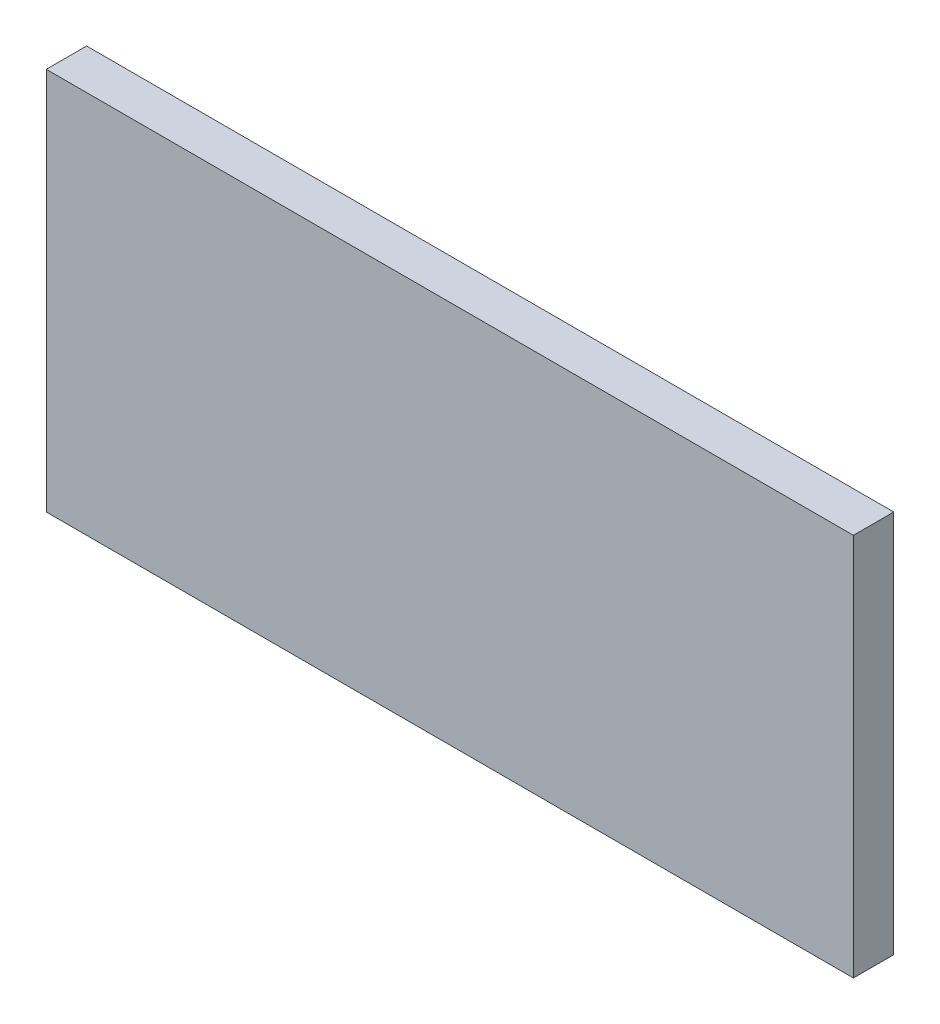
ISO-10303-21;
HEADER;
FILE_DESCRIPTION(('STEP AP214'),'2;1');
FILE_NAME('part.step','',(''),(''),'','','');
FILE_SCHEMA(('AUTOMOTIVE_DESIGN { 1 0 10303 214 1 1 1 1 }'));
ENDSEC;
DATA;
#1=APPLICATION_CONTEXT('core data for automotive mechanical design processes');
#2=APPLICATION_PROTOCOL_DEFINITION('international standard','automotive_design',2000,#1);
#3=PRODUCT_CONTEXT('',#1,'mechanical');
#4=PRODUCT('Part','Part','',(#3));
#5=PRODUCT_RELATED_PRODUCT_CATEGORY('part','',(#4));
#6=PRODUCT_DEFINITION_FORMATION('','',#4);
#7=PRODUCT_DEFINITION_CONTEXT('part definition',#1,'design');
#8=PRODUCT_DEFINITION('design','',#6,#7);
#9=PRODUCT_DEFINITION_SHAPE('','',#8);
#10=(LENGTH_UNIT() NAMED_UNIT(*) SI_UNIT(.MILLI.,.METRE.));
#11=(NAMED_UNIT(*) PLANE_ANGLE_UNIT() SI_UNIT($,.RADIAN.));
#12=(NAMED_UNIT(*) SI_UNIT($,.STERADIAN.) SOLID_ANGLE_UNIT());
#13=UNCERTAINTY_MEASURE_WITH_UNIT(LENGTH_MEASURE(1.E-05),#10,'distance_accuracy_value','');
#14=(GEOMETRIC_REPRESENTATION_CONTEXT(3) GLOBAL_UNCERTAINTY_ASSIGNED_CONTEXT((#13)) GLOBAL_UNIT_ASSIGNED_CONTEXT((#10,
#11,#12)) REPRESENTATION_CONTEXT('',''));
#15=CARTESIAN_POINT('',(0.,0.,0.));
#16=DIRECTION('',(0.,0.,1.));
#17=DIRECTION('',(1.,0.,0.));
#18=AXIS2_PLACEMENT_3D('',#15,#16,#17);
#19=CARTESIAN_POINT('',(0.,0.,2.));
#20=DIRECTION('',(1.,0.,0.));
#21=DIRECTION('',(0.,0.,-1.));
#22=AXIS2_PLACEMENT_3D('',#19,#20,#21);
#23=PLANE('',#22);
#24=DIRECTION('',(0.,-1.,0.));
#25=VECTOR('',#24,1.);
#26=CARTESIAN_POINT('',(0.,0.,0.));
#27=LINE('',#26,#25);
#28=CARTESIAN_POINT('',(0.,19.,0.));
#29=VERTEX_POINT('',#28);
#30=CARTESIAN_POINT('',(0.,0.,0.));
#31=VERTEX_POINT('',#30);
#32=EDGE_CURVE('E107',#29,#31,#27,.T.);
#33=ORIENTED_EDGE('',*,*,#32,.T.);
#34=DIRECTION('',(0.,0.,-1.));
#35=VECTOR('',#34,1.);
#36=CARTESIAN_POINT('',(0.,0.,2.));
#37=LINE('',#36,#35);
#38=CARTESIAN_POINT('',(0.,0.,2.));
#39=VERTEX_POINT('',#38);
#40=EDGE_CURVE('E11',#39,#31,#37,.T.);
#41=ORIENTED_EDGE('',*,*,#40,.F.);
#42=DIRECTION('',(0.,-1.,0.));
#43=VECTOR('',#42,1.);
#44=CARTESIAN_POINT('',(0.,0.,2.));
#45=LINE('',#44,#43);
#46=CARTESIAN_POINT('',(0.,19.,2.));
#47=VERTEX_POINT('',#46);
#48=EDGE_CURVE('E91',#47,#39,#45,.T.);
#49=ORIENTED_EDGE('',*,*,#48,.F.);
#50=DIRECTION('',(0.,0.,-1.));
#51=VECTOR('',#50,1.);
#52=CARTESIAN_POINT('',(0.,19.,2.));
#53=LINE('',#52,#51);
#54=EDGE_CURVE('E103',#47,#29,#53,.T.);
#55=ORIENTED_EDGE('',*,*,#54,.T.);
#56=EDGE_LOOP('',(#33,#41,#49,#55));
#57=FACE_BOUND('',#56,.T.);
#58=ADVANCED_FACE('F39',(#57),#23,.F.);
#59=CARTESIAN_POINT('',(0.,0.,2.));
#60=DIRECTION('',(0.,1.,0.));
#61=DIRECTION('',(0.,0.,1.));
#62=AXIS2_PLACEMENT_3D('',#59,#60,#61);
#63=PLANE('',#62);
#64=DIRECTION('',(1.,0.,0.));
#65=VECTOR('',#64,1.);
#66=CARTESIAN_POINT('',(0.,0.,0.));
#67=LINE('',#66,#65);
#68=CARTESIAN_POINT('',(40.,0.,0.));
#69=VERTEX_POINT('',#68);
#70=EDGE_CURVE('E96',#31,#69,#67,.T.);
#71=ORIENTED_EDGE('',*,*,#70,.T.);
#72=DIRECTION('',(0.,0.,-1.));
#73=VECTOR('',#72,1.);
#74=CARTESIAN_POINT('',(40.,0.,2.));
#75=LINE('',#74,#73);
#76=CARTESIAN_POINT('',(40.,0.,2.));
#77=VERTEX_POINT('',#76);
#78=EDGE_CURVE('E48',#77,#69,#75,.T.);
#79=ORIENTED_EDGE('',*,*,#78,.F.);
#80=DIRECTION('',(1.,0.,0.));
#81=VECTOR('',#80,1.);
#82=CARTESIAN_POINT('',(0.,0.,2.));
#83=LINE('',#82,#81);
#84=EDGE_CURVE('E86',#39,#77,#83,.T.);
#85=ORIENTED_EDGE('',*,*,#84,.F.);
#86=ORIENTED_EDGE('',*,*,#40,.T.);
#87=EDGE_LOOP('',(#71,#79,#85,#86));
#88=FACE_BOUND('',#87,.T.);
#89=ADVANCED_FACE('F95',(#88),#63,.F.);
#90=CARTESIAN_POINT('',(40.,0.,2.));
#91=DIRECTION('',(-1.,0.,0.));
#92=DIRECTION('',(0.,0.,1.));
#93=AXIS2_PLACEMENT_3D('',#90,#91,#92);
#94=PLANE('',#93);
#95=DIRECTION('',(0.,1.,0.));
#96=VECTOR('',#95,1.);
#97=CARTESIAN_POINT('',(40.,0.,0.));
#98=LINE('',#97,#96);
#99=CARTESIAN_POINT('',(40.,19.,0.));
#100=VERTEX_POINT('',#99);
#101=EDGE_CURVE('E73',#69,#100,#98,.T.);
#102=ORIENTED_EDGE('',*,*,#101,.T.);
#103=DIRECTION('',(0.,0.,-1.));
#104=VECTOR('',#103,1.);
#105=CARTESIAN_POINT('',(40.,19.,2.));
#106=LINE('',#105,#104);
#107=CARTESIAN_POINT('',(40.,19.,2.));
#108=VERTEX_POINT('',#107);
#109=EDGE_CURVE('E98',#108,#100,#106,.T.);
#110=ORIENTED_EDGE('',*,*,#109,.F.);
#111=DIRECTION('',(0.,1.,0.));
#112=VECTOR('',#111,1.);
#113=CARTESIAN_POINT('',(40.,0.,2.));
#114=LINE('',#113,#112);
#115=EDGE_CURVE('E89',#77,#108,#114,.T.);
#116=ORIENTED_EDGE('',*,*,#115,.F.);
#117=ORIENTED_EDGE('',*,*,#78,.T.);
#118=EDGE_LOOP('',(#102,#110,#116,#117));
#119=FACE_BOUND('',#118,.T.);
#120=ADVANCED_FACE('F99',(#119),#94,.F.);
#121=CARTESIAN_POINT('',(0.,19.,2.));
#122=DIRECTION('',(0.,-1.,0.));
#123=DIRECTION('',(0.,0.,-1.));
#124=AXIS2_PLACEMENT_3D('',#121,#122,#123);
#125=PLANE('',#124);
#126=DIRECTION('',(-1.,0.,0.));
#127=VECTOR('',#126,1.);
#128=CARTESIAN_POINT('',(0.,19.,0.));
#129=LINE('',#128,#127);
#130=EDGE_CURVE('E79',#100,#29,#129,.T.);
#131=ORIENTED_EDGE('',*,*,#130,.T.);
#132=ORIENTED_EDGE('',*,*,#54,.F.);
#133=DIRECTION('',(-1.,0.,0.));
#134=VECTOR('',#133,1.);
#135=CARTESIAN_POINT('',(0.,19.,2.));
#136=LINE('',#135,#134);
#137=EDGE_CURVE('E56',#108,#47,#136,.T.);
#138=ORIENTED_EDGE('',*,*,#137,.F.);
#139=ORIENTED_EDGE('',*,*,#109,.T.);
#140=EDGE_LOOP('',(#131,#132,#138,#139));
#141=FACE_BOUND('',#140,.T.);
#142=ADVANCED_FACE('F120',(#141),#125,.F.);
#143=CARTESIAN_POINT('',(0.,0.,2.));
#144=DIRECTION('',(0.,0.,-1.));
#145=DIRECTION('',(-1.,0.,0.));
#146=AXIS2_PLACEMENT_3D('',#143,#144,#145);
#147=PLANE('',#146);
#148=ORIENTED_EDGE('',*,*,#48,.T.);
#149=ORIENTED_EDGE('',*,*,#84,.T.);
#150=ORIENTED_EDGE('',*,*,#115,.T.);
#151=ORIENTED_EDGE('',*,*,#137,.T.);
#152=EDGE_LOOP('',(#148,#149,#150,#151));
#153=FACE_BOUND('',#152,.T.);
#154=ADVANCED_FACE('F87',(#153),#147,.F.);
#155=CARTESIAN_POINT('',(0.,0.,0.));
#156=DIRECTION('',(0.,0.,-1.));
#157=DIRECTION('',(-1.,0.,0.));
#158=AXIS2_PLACEMENT_3D('',#155,#156,#157);
#159=PLANE('',#158);
#160=ORIENTED_EDGE('',*,*,#32,.F.);
#161=ORIENTED_EDGE('',*,*,#130,.F.);
#162=ORIENTED_EDGE('',*,*,#101,.F.);
#163=ORIENTED_EDGE('',*,*,#70,.F.);
#164=EDGE_LOOP('',(#160,#161,#162,#163));
#165=FACE_BOUND('',#164,.T.);
#166=ADVANCED_FACE('F123',(#165),#159,.T.);
#167=CLOSED_SHELL('',(#58,#89,#120,#142,#154,#166));
#168=MANIFOLD_SOLID_BREP('B2',#167);
#169=ADVANCED_BREP_SHAPE_REPRESENTATION('',(#18,#168),#14);
#170=SHAPE_DEFINITION_REPRESENTATION(#9,#169);
ENDSEC;
END-ISO-10303-21;
